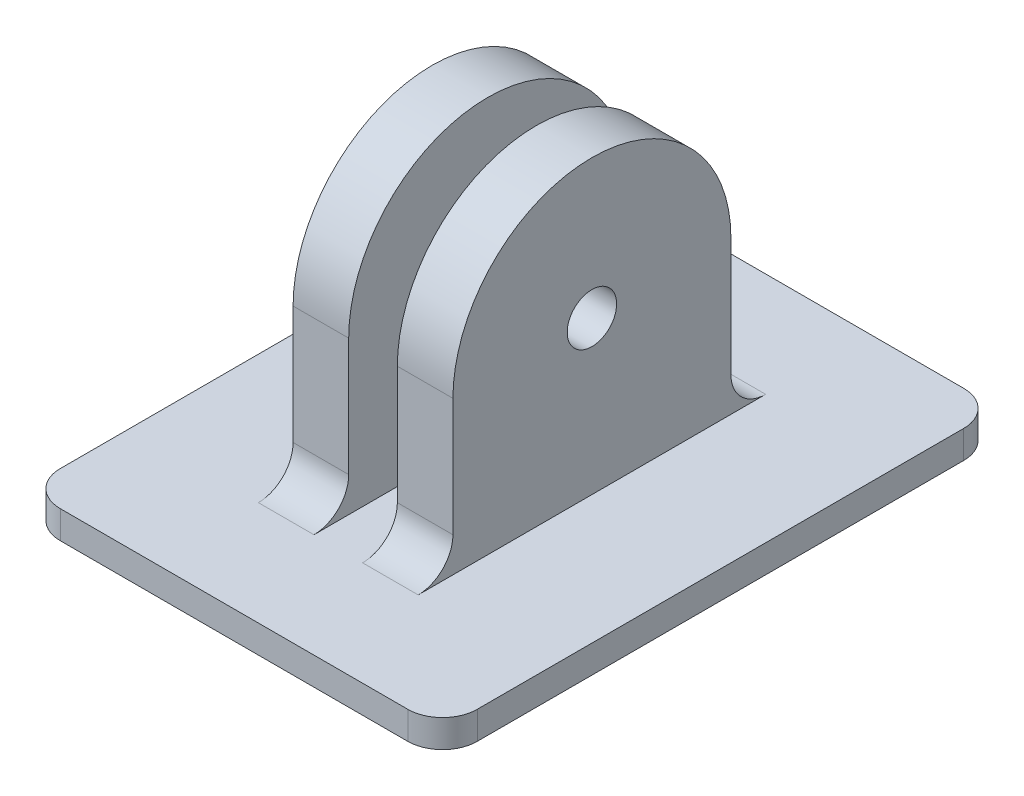
ISO-10303-21;
HEADER;
FILE_DESCRIPTION(('STEP AP214'),'2;1');
FILE_NAME('part.step','',(''),(''),'','','');
FILE_SCHEMA(('AUTOMOTIVE_DESIGN { 1 0 10303 214 1 1 1 1 }'));
ENDSEC;
DATA;
#1=APPLICATION_CONTEXT('core data for automotive mechanical design processes');
#2=APPLICATION_PROTOCOL_DEFINITION('international standard','automotive_design',2000,#1);
#3=PRODUCT_CONTEXT('',#1,'mechanical');
#4=PRODUCT('Part','Part','',(#3));
#5=PRODUCT_RELATED_PRODUCT_CATEGORY('part','',(#4));
#6=PRODUCT_DEFINITION_FORMATION('','',#4);
#7=PRODUCT_DEFINITION_CONTEXT('part definition',#1,'design');
#8=PRODUCT_DEFINITION('design','',#6,#7);
#9=PRODUCT_DEFINITION_SHAPE('','',#8);
#10=(LENGTH_UNIT() NAMED_UNIT(*) SI_UNIT(.MILLI.,.METRE.));
#11=(NAMED_UNIT(*) PLANE_ANGLE_UNIT() SI_UNIT($,.RADIAN.));
#12=(NAMED_UNIT(*) SI_UNIT($,.STERADIAN.) SOLID_ANGLE_UNIT());
#13=UNCERTAINTY_MEASURE_WITH_UNIT(LENGTH_MEASURE(1.E-05),#10,'distance_accuracy_value','');
#14=(GEOMETRIC_REPRESENTATION_CONTEXT(3) GLOBAL_UNCERTAINTY_ASSIGNED_CONTEXT((#13)) GLOBAL_UNIT_ASSIGNED_CONTEXT((#10,
#11,#12)) REPRESENTATION_CONTEXT('',''));
#15=CARTESIAN_POINT('',(0.,0.,0.));
#16=DIRECTION('',(0.,0.,1.));
#17=DIRECTION('',(1.,0.,0.));
#18=AXIS2_PLACEMENT_3D('',#15,#16,#17);
#19=CARTESIAN_POINT('',(0.,2.,0.));
#20=DIRECTION('',(0.,1.,0.));
#21=DIRECTION('',(0.,0.,1.));
#22=AXIS2_PLACEMENT_3D('',#19,#20,#21);
#23=PLANE('',#22);
#24=DIRECTION('',(0.,0.,1.));
#25=VECTOR('',#24,1.);
#26=CARTESIAN_POINT('',(1.75,2.,-10.));
#27=LINE('',#26,#25);
#28=CARTESIAN_POINT('',(1.75,2.,-12.5));
#29=VERTEX_POINT('',#28);
#30=CARTESIAN_POINT('',(1.75,2.,12.5));
#31=VERTEX_POINT('',#30);
#32=EDGE_CURVE('E233',#29,#31,#27,.T.);
#33=ORIENTED_EDGE('',*,*,#32,.F.);
#34=DIRECTION('',(-1.,0.,0.));
#35=VECTOR('',#34,1.);
#36=CARTESIAN_POINT('',(0.,2.,-12.5));
#37=LINE('',#36,#35);
#38=CARTESIAN_POINT('',(5.75,2.,-12.5));
#39=VERTEX_POINT('',#38);
#40=EDGE_CURVE('E286',#29,#39,#37,.F.);
#41=ORIENTED_EDGE('',*,*,#40,.T.);
#42=DIRECTION('',(0.,0.,-1.));
#43=VECTOR('',#42,1.);
#44=CARTESIAN_POINT('',(5.75,2.,-10.));
#45=LINE('',#44,#43);
#46=CARTESIAN_POINT('',(5.75,2.,12.5));
#47=VERTEX_POINT('',#46);
#48=EDGE_CURVE('E234',#47,#39,#45,.T.);
#49=ORIENTED_EDGE('',*,*,#48,.F.);
#50=DIRECTION('',(1.,0.,0.));
#51=VECTOR('',#50,1.);
#52=CARTESIAN_POINT('',(0.,2.,12.5));
#53=LINE('',#52,#51);
#54=EDGE_CURVE('E272',#47,#31,#53,.F.);
#55=ORIENTED_EDGE('',*,*,#54,.T.);
#56=EDGE_LOOP('',(#33,#41,#49,#55));
#57=FACE_BOUND('',#56,.T.);
#58=DIRECTION('',(0.,0.,-1.));
#59=VECTOR('',#58,1.);
#60=CARTESIAN_POINT('',(15.,2.,-20.));
#61=LINE('',#60,#59);
#62=CARTESIAN_POINT('',(15.,2.,17.5));
#63=VERTEX_POINT('',#62);
#64=CARTESIAN_POINT('',(15.,2.,-17.5));
#65=VERTEX_POINT('',#64);
#66=EDGE_CURVE('E251',#63,#65,#61,.T.);
#67=ORIENTED_EDGE('',*,*,#66,.T.);
#68=CARTESIAN_POINT('',(12.5,2.,-17.5));
#69=DIRECTION('',(0.,1.,0.));
#70=DIRECTION('',(0.,0.,1.));
#71=AXIS2_PLACEMENT_3D('',#68,#69,#70);
#72=CIRCLE('',#71,2.5);
#73=CARTESIAN_POINT('',(12.5,2.,-20.));
#74=VERTEX_POINT('',#73);
#75=EDGE_CURVE('E284',#65,#74,#72,.T.);
#76=ORIENTED_EDGE('',*,*,#75,.T.);
#77=DIRECTION('',(-1.,0.,0.));
#78=VECTOR('',#77,1.);
#79=CARTESIAN_POINT('',(-15.,2.,-20.));
#80=LINE('',#79,#78);
#81=CARTESIAN_POINT('',(-12.5,2.,-20.));
#82=VERTEX_POINT('',#81);
#83=EDGE_CURVE('E254',#74,#82,#80,.T.);
#84=ORIENTED_EDGE('',*,*,#83,.T.);
#85=CARTESIAN_POINT('',(-12.5,2.,-17.5));
#86=DIRECTION('',(0.,1.,0.));
#87=DIRECTION('',(0.,0.,1.));
#88=AXIS2_PLACEMENT_3D('',#85,#86,#87);
#89=CIRCLE('',#88,2.5);
#90=CARTESIAN_POINT('',(-15.,2.,-17.5));
#91=VERTEX_POINT('',#90);
#92=EDGE_CURVE('E282',#82,#91,#89,.T.);
#93=ORIENTED_EDGE('',*,*,#92,.T.);
#94=DIRECTION('',(0.,0.,1.));
#95=VECTOR('',#94,1.);
#96=CARTESIAN_POINT('',(-15.,2.,-20.));
#97=LINE('',#96,#95);
#98=CARTESIAN_POINT('',(-15.,2.,17.5));
#99=VERTEX_POINT('',#98);
#100=EDGE_CURVE('E244',#91,#99,#97,.T.);
#101=ORIENTED_EDGE('',*,*,#100,.T.);
#102=CARTESIAN_POINT('',(-12.5,2.,17.5));
#103=DIRECTION('',(0.,1.,0.));
#104=DIRECTION('',(0.,0.,1.));
#105=AXIS2_PLACEMENT_3D('',#102,#103,#104);
#106=CIRCLE('',#105,2.5);
#107=CARTESIAN_POINT('',(-12.5,2.,20.));
#108=VERTEX_POINT('',#107);
#109=EDGE_CURVE('E275',#99,#108,#106,.T.);
#110=ORIENTED_EDGE('',*,*,#109,.T.);
#111=DIRECTION('',(1.,0.,0.));
#112=VECTOR('',#111,1.);
#113=CARTESIAN_POINT('',(-15.,2.,20.));
#114=LINE('',#113,#112);
#115=CARTESIAN_POINT('',(12.5,2.,20.));
#116=VERTEX_POINT('',#115);
#117=EDGE_CURVE('E247',#108,#116,#114,.T.);
#118=ORIENTED_EDGE('',*,*,#117,.T.);
#119=CARTESIAN_POINT('',(12.5,2.,17.5));
#120=DIRECTION('',(0.,1.,0.));
#121=DIRECTION('',(0.,0.,1.));
#122=AXIS2_PLACEMENT_3D('',#119,#120,#121);
#123=CIRCLE('',#122,2.5);
#124=EDGE_CURVE('E277',#116,#63,#123,.T.);
#125=ORIENTED_EDGE('',*,*,#124,.T.);
#126=EDGE_LOOP('',(#67,#76,#84,#93,#101,#110,#118,#125));
#127=FACE_BOUND('',#126,.T.);
#128=DIRECTION('',(0.,0.,1.));
#129=VECTOR('',#128,1.);
#130=CARTESIAN_POINT('',(-5.75,2.,-9.99999999999999));
#131=LINE('',#130,#129);
#132=CARTESIAN_POINT('',(-5.75,2.,-12.5));
#133=VERTEX_POINT('',#132);
#134=CARTESIAN_POINT('',(-5.75,2.,12.5));
#135=VERTEX_POINT('',#134);
#136=EDGE_CURVE('E217',#133,#135,#131,.T.);
#137=ORIENTED_EDGE('',*,*,#136,.F.);
#138=DIRECTION('',(-1.,0.,0.));
#139=VECTOR('',#138,1.);
#140=CARTESIAN_POINT('',(0.,2.,-12.5));
#141=LINE('',#140,#139);
#142=CARTESIAN_POINT('',(-1.75,2.,-12.5));
#143=VERTEX_POINT('',#142);
#144=EDGE_CURVE('E279',#133,#143,#141,.F.);
#145=ORIENTED_EDGE('',*,*,#144,.T.);
#146=DIRECTION('',(0.,0.,-1.));
#147=VECTOR('',#146,1.);
#148=CARTESIAN_POINT('',(-1.75,2.,-9.99999999999999));
#149=LINE('',#148,#147);
#150=CARTESIAN_POINT('',(-1.75,2.,12.5));
#151=VERTEX_POINT('',#150);
#152=EDGE_CURVE('E210',#151,#143,#149,.T.);
#153=ORIENTED_EDGE('',*,*,#152,.F.);
#154=DIRECTION('',(1.,0.,0.));
#155=VECTOR('',#154,1.);
#156=CARTESIAN_POINT('',(0.,2.,12.5));
#157=LINE('',#156,#155);
#158=EDGE_CURVE('E269',#151,#135,#157,.F.);
#159=ORIENTED_EDGE('',*,*,#158,.T.);
#160=EDGE_LOOP('',(#137,#145,#153,#159));
#161=FACE_BOUND('',#160,.T.);
#162=ADVANCED_FACE('F36',(#57,#127,#161),#23,.T.);
#163=CARTESIAN_POINT('',(-15.,2.,-20.));
#164=DIRECTION('',(1.,0.,0.));
#165=DIRECTION('',(0.,0.,-1.));
#166=AXIS2_PLACEMENT_3D('',#163,#164,#165);
#167=PLANE('',#166);
#168=ORIENTED_EDGE('',*,*,#100,.F.);
#169=DIRECTION('',(0.,-1.,0.));
#170=VECTOR('',#169,1.);
#171=CARTESIAN_POINT('',(-15.,2.,-17.5));
#172=LINE('',#171,#170);
#173=CARTESIAN_POINT('',(-15.,0.,-17.5));
#174=VERTEX_POINT('',#173);
#175=EDGE_CURVE('E309',#91,#174,#172,.T.);
#176=ORIENTED_EDGE('',*,*,#175,.T.);
#177=DIRECTION('',(0.,0.,1.));
#178=VECTOR('',#177,1.);
#179=CARTESIAN_POINT('',(-15.,0.,-20.));
#180=LINE('',#179,#178);
#181=CARTESIAN_POINT('',(-15.,0.,17.5));
#182=VERTEX_POINT('',#181);
#183=EDGE_CURVE('E243',#174,#182,#180,.T.);
#184=ORIENTED_EDGE('',*,*,#183,.T.);
#185=DIRECTION('',(0.,-1.,0.));
#186=VECTOR('',#185,1.);
#187=CARTESIAN_POINT('',(-15.,2.,17.5));
#188=LINE('',#187,#186);
#189=EDGE_CURVE('E307',#182,#99,#188,.F.);
#190=ORIENTED_EDGE('',*,*,#189,.T.);
#191=EDGE_LOOP('',(#168,#176,#184,#190));
#192=FACE_BOUND('',#191,.T.);
#193=ADVANCED_FACE('F366',(#192),#167,.F.);
#194=CARTESIAN_POINT('',(-15.,2.,20.));
#195=DIRECTION('',(0.,0.,-1.));
#196=DIRECTION('',(-1.,0.,0.));
#197=AXIS2_PLACEMENT_3D('',#194,#195,#196);
#198=PLANE('',#197);
#199=DIRECTION('',(1.,0.,0.));
#200=VECTOR('',#199,1.);
#201=CARTESIAN_POINT('',(-15.,0.,20.));
#202=LINE('',#201,#200);
#203=CARTESIAN_POINT('',(-12.5,0.,20.));
#204=VERTEX_POINT('',#203);
#205=CARTESIAN_POINT('',(12.5,0.,20.));
#206=VERTEX_POINT('',#205);
#207=EDGE_CURVE('E260',#204,#206,#202,.T.);
#208=ORIENTED_EDGE('',*,*,#207,.T.);
#209=DIRECTION('',(0.,-1.,0.));
#210=VECTOR('',#209,1.);
#211=CARTESIAN_POINT('',(12.5,2.,20.));
#212=LINE('',#211,#210);
#213=EDGE_CURVE('E318',#206,#116,#212,.F.);
#214=ORIENTED_EDGE('',*,*,#213,.T.);
#215=ORIENTED_EDGE('',*,*,#117,.F.);
#216=DIRECTION('',(0.,-1.,0.));
#217=VECTOR('',#216,1.);
#218=CARTESIAN_POINT('',(-12.5,2.,20.));
#219=LINE('',#218,#217);
#220=EDGE_CURVE('E315',#108,#204,#219,.T.);
#221=ORIENTED_EDGE('',*,*,#220,.T.);
#222=EDGE_LOOP('',(#208,#214,#215,#221));
#223=FACE_BOUND('',#222,.T.);
#224=ADVANCED_FACE('F372',(#223),#198,.F.);
#225=CARTESIAN_POINT('',(15.,2.,-20.));
#226=DIRECTION('',(-1.,0.,0.));
#227=DIRECTION('',(0.,0.,1.));
#228=AXIS2_PLACEMENT_3D('',#225,#226,#227);
#229=PLANE('',#228);
#230=DIRECTION('',(0.,0.,-1.));
#231=VECTOR('',#230,1.);
#232=CARTESIAN_POINT('',(15.,0.,-20.));
#233=LINE('',#232,#231);
#234=CARTESIAN_POINT('',(15.,0.,17.5));
#235=VERTEX_POINT('',#234);
#236=CARTESIAN_POINT('',(15.,0.,-17.5));
#237=VERTEX_POINT('',#236);
#238=EDGE_CURVE('E263',#235,#237,#233,.T.);
#239=ORIENTED_EDGE('',*,*,#238,.T.);
#240=DIRECTION('',(0.,-1.,0.));
#241=VECTOR('',#240,1.);
#242=CARTESIAN_POINT('',(15.,2.,-17.5));
#243=LINE('',#242,#241);
#244=EDGE_CURVE('E305',#237,#65,#243,.F.);
#245=ORIENTED_EDGE('',*,*,#244,.T.);
#246=ORIENTED_EDGE('',*,*,#66,.F.);
#247=DIRECTION('',(0.,-1.,0.));
#248=VECTOR('',#247,1.);
#249=CARTESIAN_POINT('',(15.,2.,17.5));
#250=LINE('',#249,#248);
#251=EDGE_CURVE('E302',#63,#235,#250,.T.);
#252=ORIENTED_EDGE('',*,*,#251,.T.);
#253=EDGE_LOOP('',(#239,#245,#246,#252));
#254=FACE_BOUND('',#253,.T.);
#255=ADVANCED_FACE('F387',(#254),#229,.F.);
#256=CARTESIAN_POINT('',(-15.,2.,-20.));
#257=DIRECTION('',(0.,0.,1.));
#258=DIRECTION('',(1.,0.,0.));
#259=AXIS2_PLACEMENT_3D('',#256,#257,#258);
#260=PLANE('',#259);
#261=ORIENTED_EDGE('',*,*,#83,.F.);
#262=DIRECTION('',(0.,-1.,0.));
#263=VECTOR('',#262,1.);
#264=CARTESIAN_POINT('',(12.5,2.,-20.));
#265=LINE('',#264,#263);
#266=CARTESIAN_POINT('',(12.5,0.,-20.));
#267=VERTEX_POINT('',#266);
#268=EDGE_CURVE('E291',#74,#267,#265,.T.);
#269=ORIENTED_EDGE('',*,*,#268,.T.);
#270=DIRECTION('',(-1.,0.,0.));
#271=VECTOR('',#270,1.);
#272=CARTESIAN_POINT('',(-15.,0.,-20.));
#273=LINE('',#272,#271);
#274=CARTESIAN_POINT('',(-12.5,0.,-20.));
#275=VERTEX_POINT('',#274);
#276=EDGE_CURVE('E248',#267,#275,#273,.T.);
#277=ORIENTED_EDGE('',*,*,#276,.T.);
#278=DIRECTION('',(0.,-1.,0.));
#279=VECTOR('',#278,1.);
#280=CARTESIAN_POINT('',(-12.5,2.,-20.));
#281=LINE('',#280,#279);
#282=EDGE_CURVE('E289',#275,#82,#281,.F.);
#283=ORIENTED_EDGE('',*,*,#282,.T.);
#284=EDGE_LOOP('',(#261,#269,#277,#283));
#285=FACE_BOUND('',#284,.T.);
#286=ADVANCED_FACE('F383',(#285),#260,.F.);
#287=CARTESIAN_POINT('',(0.,0.,0.));
#288=DIRECTION('',(0.,1.,0.));
#289=DIRECTION('',(0.,0.,1.));
#290=AXIS2_PLACEMENT_3D('',#287,#288,#289);
#291=PLANE('',#290);
#292=ORIENTED_EDGE('',*,*,#276,.F.);
#293=CARTESIAN_POINT('',(12.5,0.,-17.5));
#294=DIRECTION('',(0.,1.,0.));
#295=DIRECTION('',(0.,0.,1.));
#296=AXIS2_PLACEMENT_3D('',#293,#294,#295);
#297=CIRCLE('',#296,2.5);
#298=EDGE_CURVE('E300',#267,#237,#297,.F.);
#299=ORIENTED_EDGE('',*,*,#298,.T.);
#300=ORIENTED_EDGE('',*,*,#238,.F.);
#301=CARTESIAN_POINT('',(12.5,0.,17.5));
#302=DIRECTION('',(0.,1.,0.));
#303=DIRECTION('',(0.,0.,1.));
#304=AXIS2_PLACEMENT_3D('',#301,#302,#303);
#305=CIRCLE('',#304,2.5);
#306=EDGE_CURVE('E296',#235,#206,#305,.F.);
#307=ORIENTED_EDGE('',*,*,#306,.T.);
#308=ORIENTED_EDGE('',*,*,#207,.F.);
#309=CARTESIAN_POINT('',(-12.5,0.,17.5));
#310=DIRECTION('',(0.,1.,0.));
#311=DIRECTION('',(0.,0.,1.));
#312=AXIS2_PLACEMENT_3D('',#309,#310,#311);
#313=CIRCLE('',#312,2.5);
#314=EDGE_CURVE('E294',#204,#182,#313,.F.);
#315=ORIENTED_EDGE('',*,*,#314,.T.);
#316=ORIENTED_EDGE('',*,*,#183,.F.);
#317=CARTESIAN_POINT('',(-12.5,0.,-17.5));
#318=DIRECTION('',(0.,1.,0.));
#319=DIRECTION('',(0.,0.,1.));
#320=AXIS2_PLACEMENT_3D('',#317,#318,#319);
#321=CIRCLE('',#320,2.5);
#322=EDGE_CURVE('E298',#174,#275,#321,.F.);
#323=ORIENTED_EDGE('',*,*,#322,.T.);
#324=EDGE_LOOP('',(#292,#299,#300,#307,#308,#315,#316,#323));
#325=FACE_BOUND('',#324,.T.);
#326=ADVANCED_FACE('F380',(#325),#291,.F.);
#327=CARTESIAN_POINT('',(1.75,13.,-10.));
#328=DIRECTION('',(1.,0.,0.));
#329=DIRECTION('',(0.,0.,-1.));
#330=AXIS2_PLACEMENT_3D('',#327,#328,#329);
#331=PLANE('',#330);
#332=CARTESIAN_POINT('',(1.75,13.,0.));
#333=DIRECTION('',(1.,0.,0.));
#334=DIRECTION('',(0.,0.,-1.));
#335=AXIS2_PLACEMENT_3D('',#332,#333,#334);
#336=CIRCLE('',#335,1.778);
#337=CARTESIAN_POINT('',(1.75,13.,-1.778));
#338=VERTEX_POINT('',#337);
#339=EDGE_CURVE('E199',#338,#338,#336,.T.);
#340=ORIENTED_EDGE('',*,*,#339,.T.);
#341=EDGE_LOOP('',(#340));
#342=FACE_BOUND('',#341,.T.);
#343=ORIENTED_EDGE('',*,*,#32,.T.);
#344=CARTESIAN_POINT('',(1.75,4.5,12.5));
#345=DIRECTION('',(1.,0.,0.));
#346=DIRECTION('',(0.,0.,-1.));
#347=AXIS2_PLACEMENT_3D('',#344,#345,#346);
#348=CIRCLE('',#347,2.5);
#349=CARTESIAN_POINT('',(1.75,4.5,10.));
#350=VERTEX_POINT('',#349);
#351=EDGE_CURVE('E337',#31,#350,#348,.T.);
#352=ORIENTED_EDGE('',*,*,#351,.T.);
#353=DIRECTION('',(0.,-1.,0.));
#354=VECTOR('',#353,1.);
#355=CARTESIAN_POINT('',(1.75,13.,10.));
#356=LINE('',#355,#354);
#357=CARTESIAN_POINT('',(1.75,13.,10.));
#358=VERTEX_POINT('',#357);
#359=EDGE_CURVE('E240',#358,#350,#356,.T.);
#360=ORIENTED_EDGE('',*,*,#359,.F.);
#361=CARTESIAN_POINT('',(1.75,13.,0.));
#362=DIRECTION('',(1.,0.,0.));
#363=DIRECTION('',(0.,0.,1.));
#364=AXIS2_PLACEMENT_3D('',#361,#362,#363);
#365=CIRCLE('',#364,10.);
#366=CARTESIAN_POINT('',(1.75,13.,-10.));
#367=VERTEX_POINT('',#366);
#368=EDGE_CURVE('E198',#367,#358,#365,.T.);
#369=ORIENTED_EDGE('',*,*,#368,.F.);
#370=DIRECTION('',(0.,-1.,0.));
#371=VECTOR('',#370,1.);
#372=CARTESIAN_POINT('',(1.75,13.,-10.));
#373=LINE('',#372,#371);
#374=CARTESIAN_POINT('',(1.75,4.5,-10.));
#375=VERTEX_POINT('',#374);
#376=EDGE_CURVE('E180',#367,#375,#373,.T.);
#377=ORIENTED_EDGE('',*,*,#376,.T.);
#378=CARTESIAN_POINT('',(1.75,4.5,-12.5));
#379=DIRECTION('',(1.,0.,0.));
#380=DIRECTION('',(0.,0.,-1.));
#381=AXIS2_PLACEMENT_3D('',#378,#379,#380);
#382=CIRCLE('',#381,2.5);
#383=EDGE_CURVE('E325',#375,#29,#382,.T.);
#384=ORIENTED_EDGE('',*,*,#383,.T.);
#385=EDGE_LOOP('',(#343,#352,#360,#369,#377,#384));
#386=FACE_BOUND('',#385,.T.);
#387=ADVANCED_FACE('F378',(#342,#386),#331,.F.);
#388=CARTESIAN_POINT('',(1.75,13.,10.));
#389=DIRECTION('',(0.,0.,-1.));
#390=DIRECTION('',(-1.,0.,0.));
#391=AXIS2_PLACEMENT_3D('',#388,#389,#390);
#392=PLANE('',#391);
#393=ORIENTED_EDGE('',*,*,#359,.T.);
#394=DIRECTION('',(1.,0.,0.));
#395=VECTOR('',#394,1.);
#396=CARTESIAN_POINT('',(1.75,4.5,10.));
#397=LINE('',#396,#395);
#398=CARTESIAN_POINT('',(5.75,4.5,10.));
#399=VERTEX_POINT('',#398);
#400=EDGE_CURVE('E320',#350,#399,#397,.T.);
#401=ORIENTED_EDGE('',*,*,#400,.T.);
#402=DIRECTION('',(0.,-1.,0.));
#403=VECTOR('',#402,1.);
#404=CARTESIAN_POINT('',(5.75,13.,10.));
#405=LINE('',#404,#403);
#406=CARTESIAN_POINT('',(5.75,13.,10.));
#407=VERTEX_POINT('',#406);
#408=EDGE_CURVE('E194',#407,#399,#405,.T.);
#409=ORIENTED_EDGE('',*,*,#408,.F.);
#410=DIRECTION('',(1.,0.,0.));
#411=VECTOR('',#410,1.);
#412=CARTESIAN_POINT('',(1.75,13.,10.));
#413=LINE('',#412,#411);
#414=EDGE_CURVE('E185',#358,#407,#413,.T.);
#415=ORIENTED_EDGE('',*,*,#414,.F.);
#416=EDGE_LOOP('',(#393,#401,#409,#415));
#417=FACE_BOUND('',#416,.T.);
#418=ADVANCED_FACE('F429',(#417),#392,.F.);
#419=CARTESIAN_POINT('',(5.75,13.,-10.));
#420=DIRECTION('',(-1.,0.,0.));
#421=DIRECTION('',(0.,0.,1.));
#422=AXIS2_PLACEMENT_3D('',#419,#420,#421);
#423=PLANE('',#422);
#424=CARTESIAN_POINT('',(5.75,13.,0.));
#425=DIRECTION('',(1.,0.,0.));
#426=DIRECTION('',(0.,0.,-1.));
#427=AXIS2_PLACEMENT_3D('',#424,#425,#426);
#428=CIRCLE('',#427,1.778);
#429=CARTESIAN_POINT('',(5.75,13.,-1.778));
#430=VERTEX_POINT('',#429);
#431=EDGE_CURVE('E621',#430,#430,#428,.T.);
#432=ORIENTED_EDGE('',*,*,#431,.F.);
#433=EDGE_LOOP('',(#432));
#434=FACE_BOUND('',#433,.T.);
#435=ORIENTED_EDGE('',*,*,#48,.T.);
#436=CARTESIAN_POINT('',(5.75,4.5,-12.5));
#437=DIRECTION('',(-1.,0.,0.));
#438=DIRECTION('',(0.,0.,1.));
#439=AXIS2_PLACEMENT_3D('',#436,#437,#438);
#440=CIRCLE('',#439,2.5);
#441=CARTESIAN_POINT('',(5.75,4.5,-10.));
#442=VERTEX_POINT('',#441);
#443=EDGE_CURVE('E193',#39,#442,#440,.T.);
#444=ORIENTED_EDGE('',*,*,#443,.T.);
#445=DIRECTION('',(0.,-1.,0.));
#446=VECTOR('',#445,1.);
#447=CARTESIAN_POINT('',(5.75,13.,-10.));
#448=LINE('',#447,#446);
#449=CARTESIAN_POINT('',(5.75,13.,-9.99999999999999));
#450=VERTEX_POINT('',#449);
#451=EDGE_CURVE('E177',#450,#442,#448,.T.);
#452=ORIENTED_EDGE('',*,*,#451,.F.);
#453=CARTESIAN_POINT('',(5.75,13.,0.));
#454=DIRECTION('',(1.,0.,0.));
#455=DIRECTION('',(0.,0.,1.));
#456=AXIS2_PLACEMENT_3D('',#453,#454,#455);
#457=CIRCLE('',#456,10.);
#458=EDGE_CURVE('E191',#450,#407,#457,.T.);
#459=ORIENTED_EDGE('',*,*,#458,.T.);
#460=ORIENTED_EDGE('',*,*,#408,.T.);
#461=CARTESIAN_POINT('',(5.75,4.5,12.5));
#462=DIRECTION('',(-1.,0.,0.));
#463=DIRECTION('',(0.,0.,1.));
#464=AXIS2_PLACEMENT_3D('',#461,#462,#463);
#465=CIRCLE('',#464,2.5);
#466=EDGE_CURVE('E334',#399,#47,#465,.T.);
#467=ORIENTED_EDGE('',*,*,#466,.T.);
#468=EDGE_LOOP('',(#435,#444,#452,#459,#460,#467));
#469=FACE_BOUND('',#468,.T.);
#470=ADVANCED_FACE('F189',(#434,#469),#423,.F.);
#471=CARTESIAN_POINT('',(1.75,13.,-10.));
#472=DIRECTION('',(0.,0.,1.));
#473=DIRECTION('',(1.,0.,0.));
#474=AXIS2_PLACEMENT_3D('',#471,#472,#473);
#475=PLANE('',#474);
#476=ORIENTED_EDGE('',*,*,#451,.T.);
#477=DIRECTION('',(-1.,0.,0.));
#478=VECTOR('',#477,1.);
#479=CARTESIAN_POINT('',(1.75,4.5,-10.));
#480=LINE('',#479,#478);
#481=EDGE_CURVE('E257',#442,#375,#480,.T.);
#482=ORIENTED_EDGE('',*,*,#481,.T.);
#483=ORIENTED_EDGE('',*,*,#376,.F.);
#484=DIRECTION('',(-1.,0.,0.));
#485=VECTOR('',#484,1.);
#486=CARTESIAN_POINT('',(1.75,13.,-10.));
#487=LINE('',#486,#485);
#488=EDGE_CURVE('E173',#450,#367,#487,.T.);
#489=ORIENTED_EDGE('',*,*,#488,.F.);
#490=EDGE_LOOP('',(#476,#482,#483,#489));
#491=FACE_BOUND('',#490,.T.);
#492=ADVANCED_FACE('F175',(#491),#475,.F.);
#493=CARTESIAN_POINT('',(-1.75,13.,-9.99999999999999));
#494=DIRECTION('',(-1.,0.,0.));
#495=DIRECTION('',(0.,0.,1.));
#496=AXIS2_PLACEMENT_3D('',#493,#494,#495);
#497=PLANE('',#496);
#498=CARTESIAN_POINT('',(-1.75,13.,0.));
#499=DIRECTION('',(-1.,0.,0.));
#500=DIRECTION('',(0.,0.,1.));
#501=AXIS2_PLACEMENT_3D('',#498,#499,#500);
#502=CIRCLE('',#501,1.778);
#503=CARTESIAN_POINT('',(-1.75,13.,1.778));
#504=VERTEX_POINT('',#503);
#505=EDGE_CURVE('E204',#504,#504,#502,.T.);
#506=ORIENTED_EDGE('',*,*,#505,.T.);
#507=EDGE_LOOP('',(#506));
#508=FACE_BOUND('',#507,.T.);
#509=ORIENTED_EDGE('',*,*,#152,.T.);
#510=CARTESIAN_POINT('',(-1.75,4.5,-12.5));
#511=DIRECTION('',(-1.,0.,0.));
#512=DIRECTION('',(0.,0.,1.));
#513=AXIS2_PLACEMENT_3D('',#510,#511,#512);
#514=CIRCLE('',#513,2.5);
#515=CARTESIAN_POINT('',(-1.75,4.5,-9.99999999999999));
#516=VERTEX_POINT('',#515);
#517=EDGE_CURVE('E332',#143,#516,#514,.T.);
#518=ORIENTED_EDGE('',*,*,#517,.T.);
#519=DIRECTION('',(0.,-1.,0.));
#520=VECTOR('',#519,1.);
#521=CARTESIAN_POINT('',(-1.75,13.,-9.99999999999999));
#522=LINE('',#521,#520);
#523=CARTESIAN_POINT('',(-1.75,13.,-9.99999999999999));
#524=VERTEX_POINT('',#523);
#525=EDGE_CURVE('E230',#524,#516,#522,.T.);
#526=ORIENTED_EDGE('',*,*,#525,.F.);
#527=CARTESIAN_POINT('',(-1.75,13.,0.));
#528=DIRECTION('',(-1.,0.,0.));
#529=DIRECTION('',(0.,0.,-1.));
#530=AXIS2_PLACEMENT_3D('',#527,#528,#529);
#531=CIRCLE('',#530,9.99999999999999);
#532=CARTESIAN_POINT('',(-1.75,13.,9.99999999999999));
#533=VERTEX_POINT('',#532);
#534=EDGE_CURVE('E207',#533,#524,#531,.T.);
#535=ORIENTED_EDGE('',*,*,#534,.F.);
#536=DIRECTION('',(0.,-1.,0.));
#537=VECTOR('',#536,1.);
#538=CARTESIAN_POINT('',(-1.75,13.,9.99999999999999));
#539=LINE('',#538,#537);
#540=CARTESIAN_POINT('',(-1.75,4.5,9.99999999999999));
#541=VERTEX_POINT('',#540);
#542=EDGE_CURVE('E220',#533,#541,#539,.T.);
#543=ORIENTED_EDGE('',*,*,#542,.T.);
#544=CARTESIAN_POINT('',(-1.75,4.5,12.5));
#545=DIRECTION('',(-1.,0.,0.));
#546=DIRECTION('',(0.,0.,1.));
#547=AXIS2_PLACEMENT_3D('',#544,#545,#546);
#548=CIRCLE('',#547,2.5);
#549=EDGE_CURVE('E44',#541,#151,#548,.T.);
#550=ORIENTED_EDGE('',*,*,#549,.T.);
#551=EDGE_LOOP('',(#509,#518,#526,#535,#543,#550));
#552=FACE_BOUND('',#551,.T.);
#553=ADVANCED_FACE('F339',(#508,#552),#497,.F.);
#554=CARTESIAN_POINT('',(-1.75,13.,-9.99999999999999));
#555=DIRECTION('',(0.,0.,1.));
#556=DIRECTION('',(1.,0.,0.));
#557=AXIS2_PLACEMENT_3D('',#554,#555,#556);
#558=PLANE('',#557);
#559=ORIENTED_EDGE('',*,*,#525,.T.);
#560=DIRECTION('',(-1.,0.,0.));
#561=VECTOR('',#560,1.);
#562=CARTESIAN_POINT('',(-1.75,4.5,-9.99999999999999));
#563=LINE('',#562,#561);
#564=CARTESIAN_POINT('',(-5.75,4.5,-9.99999999999999));
#565=VERTEX_POINT('',#564);
#566=EDGE_CURVE('E312',#516,#565,#563,.T.);
#567=ORIENTED_EDGE('',*,*,#566,.T.);
#568=DIRECTION('',(0.,-1.,0.));
#569=VECTOR('',#568,1.);
#570=CARTESIAN_POINT('',(-5.75,13.,-9.99999999999999));
#571=LINE('',#570,#569);
#572=CARTESIAN_POINT('',(-5.75,13.,-9.99999999999999));
#573=VERTEX_POINT('',#572);
#574=EDGE_CURVE('E227',#573,#565,#571,.T.);
#575=ORIENTED_EDGE('',*,*,#574,.F.);
#576=DIRECTION('',(-1.,0.,0.));
#577=VECTOR('',#576,1.);
#578=CARTESIAN_POINT('',(-1.75,13.,-9.99999999999999));
#579=LINE('',#578,#577);
#580=EDGE_CURVE('E213',#524,#573,#579,.T.);
#581=ORIENTED_EDGE('',*,*,#580,.F.);
#582=EDGE_LOOP('',(#559,#567,#575,#581));
#583=FACE_BOUND('',#582,.T.);
#584=ADVANCED_FACE('F349',(#583),#558,.F.);
#585=CARTESIAN_POINT('',(-5.75,13.,-9.99999999999999));
#586=DIRECTION('',(1.,0.,0.));
#587=DIRECTION('',(0.,0.,-1.));
#588=AXIS2_PLACEMENT_3D('',#585,#586,#587);
#589=PLANE('',#588);
#590=CARTESIAN_POINT('',(-5.75,13.,0.));
#591=DIRECTION('',(1.,0.,0.));
#592=DIRECTION('',(0.,0.,-1.));
#593=AXIS2_PLACEMENT_3D('',#590,#591,#592);
#594=CIRCLE('',#593,1.778);
#595=CARTESIAN_POINT('',(-5.75,13.,-1.778));
#596=VERTEX_POINT('',#595);
#597=EDGE_CURVE('E617',#596,#596,#594,.F.);
#598=ORIENTED_EDGE('',*,*,#597,.F.);
#599=EDGE_LOOP('',(#598));
#600=FACE_BOUND('',#599,.T.);
#601=ORIENTED_EDGE('',*,*,#136,.T.);
#602=CARTESIAN_POINT('',(-5.75,4.5,12.5));
#603=DIRECTION('',(1.,0.,0.));
#604=DIRECTION('',(0.,0.,-1.));
#605=AXIS2_PLACEMENT_3D('',#602,#603,#604);
#606=CIRCLE('',#605,2.5);
#607=CARTESIAN_POINT('',(-5.75,4.5,9.99999999999999));
#608=VERTEX_POINT('',#607);
#609=EDGE_CURVE('E11',#135,#608,#606,.T.);
#610=ORIENTED_EDGE('',*,*,#609,.T.);
#611=DIRECTION('',(0.,-1.,0.));
#612=VECTOR('',#611,1.);
#613=CARTESIAN_POINT('',(-5.75,13.,9.99999999999999));
#614=LINE('',#613,#612);
#615=CARTESIAN_POINT('',(-5.75,13.,9.99999999999999));
#616=VERTEX_POINT('',#615);
#617=EDGE_CURVE('E225',#616,#608,#614,.T.);
#618=ORIENTED_EDGE('',*,*,#617,.F.);
#619=CARTESIAN_POINT('',(-5.75,13.,0.));
#620=DIRECTION('',(-1.,0.,0.));
#621=DIRECTION('',(0.,0.,-1.));
#622=AXIS2_PLACEMENT_3D('',#619,#620,#621);
#623=CIRCLE('',#622,9.99999999999999);
#624=EDGE_CURVE('E201',#616,#573,#623,.T.);
#625=ORIENTED_EDGE('',*,*,#624,.T.);
#626=ORIENTED_EDGE('',*,*,#574,.T.);
#627=CARTESIAN_POINT('',(-5.75,4.5,-12.5));
#628=DIRECTION('',(1.,0.,0.));
#629=DIRECTION('',(0.,0.,-1.));
#630=AXIS2_PLACEMENT_3D('',#627,#628,#629);
#631=CIRCLE('',#630,2.5);
#632=EDGE_CURVE('E329',#565,#133,#631,.T.);
#633=ORIENTED_EDGE('',*,*,#632,.T.);
#634=EDGE_LOOP('',(#601,#610,#618,#625,#626,#633));
#635=FACE_BOUND('',#634,.T.);
#636=ADVANCED_FACE('F353',(#600,#635),#589,.F.);
#637=CARTESIAN_POINT('',(-1.75,13.,9.99999999999999));
#638=DIRECTION('',(0.,0.,-1.));
#639=DIRECTION('',(-1.,0.,0.));
#640=AXIS2_PLACEMENT_3D('',#637,#638,#639);
#641=PLANE('',#640);
#642=ORIENTED_EDGE('',*,*,#617,.T.);
#643=DIRECTION('',(1.,0.,0.));
#644=VECTOR('',#643,1.);
#645=CARTESIAN_POINT('',(-1.75,4.5,9.99999999999999));
#646=LINE('',#645,#644);
#647=EDGE_CURVE('E323',#608,#541,#646,.T.);
#648=ORIENTED_EDGE('',*,*,#647,.T.);
#649=ORIENTED_EDGE('',*,*,#542,.F.);
#650=DIRECTION('',(1.,0.,0.));
#651=VECTOR('',#650,1.);
#652=CARTESIAN_POINT('',(-1.75,13.,9.99999999999999));
#653=LINE('',#652,#651);
#654=EDGE_CURVE('E216',#616,#533,#653,.T.);
#655=ORIENTED_EDGE('',*,*,#654,.F.);
#656=EDGE_LOOP('',(#642,#648,#649,#655));
#657=FACE_BOUND('',#656,.T.);
#658=ADVANCED_FACE('F355',(#657),#641,.F.);
#659=CARTESIAN_POINT('',(-1.75,13.,0.));
#660=DIRECTION('',(-1.,0.,0.));
#661=DIRECTION('',(0.,0.,1.));
#662=AXIS2_PLACEMENT_3D('',#659,#660,#661);
#663=CYLINDRICAL_SURFACE('',#662,9.99999999999999);
#664=ORIENTED_EDGE('',*,*,#624,.F.);
#665=ORIENTED_EDGE('',*,*,#654,.T.);
#666=ORIENTED_EDGE('',*,*,#534,.T.);
#667=ORIENTED_EDGE('',*,*,#580,.T.);
#668=EDGE_LOOP('',(#664,#665,#666,#667));
#669=FACE_BOUND('',#668,.T.);
#670=ADVANCED_FACE('F352',(#669),#663,.T.);
#671=CARTESIAN_POINT('',(1.75,13.,0.));
#672=DIRECTION('',(1.,0.,0.));
#673=DIRECTION('',(0.,0.,-1.));
#674=AXIS2_PLACEMENT_3D('',#671,#672,#673);
#675=CYLINDRICAL_SURFACE('',#674,10.);
#676=ORIENTED_EDGE('',*,*,#458,.F.);
#677=ORIENTED_EDGE('',*,*,#488,.T.);
#678=ORIENTED_EDGE('',*,*,#368,.T.);
#679=ORIENTED_EDGE('',*,*,#414,.T.);
#680=EDGE_LOOP('',(#676,#677,#678,#679));
#681=FACE_BOUND('',#680,.T.);
#682=ADVANCED_FACE('F197',(#681),#675,.T.);
#683=CARTESIAN_POINT('',(-10.7789434277987,13.,0.));
#684=DIRECTION('',(1.,0.,0.));
#685=DIRECTION('',(0.,0.,-1.));
#686=AXIS2_PLACEMENT_3D('',#683,#684,#685);
#687=CYLINDRICAL_SURFACE('',#686,1.778);
#688=ORIENTED_EDGE('',*,*,#597,.T.);
#689=EDGE_LOOP('',(#688));
#690=FACE_BOUND('',#689,.T.);
#691=ORIENTED_EDGE('',*,*,#505,.F.);
#692=EDGE_LOOP('',(#691));
#693=FACE_BOUND('',#692,.T.);
#694=ADVANCED_FACE('F516',(#690,#693),#687,.F.);
#695=ORIENTED_EDGE('',*,*,#431,.T.);
#696=EDGE_LOOP('',(#695));
#697=FACE_BOUND('',#696,.T.);
#698=ORIENTED_EDGE('',*,*,#339,.F.);
#699=EDGE_LOOP('',(#698));
#700=FACE_BOUND('',#699,.T.);
#701=ADVANCED_FACE('F399',(#697,#700),#687,.F.);
#702=CARTESIAN_POINT('',(1.75,4.5,-12.5));
#703=DIRECTION('',(-1.,0.,0.));
#704=DIRECTION('',(0.,0.,1.));
#705=AXIS2_PLACEMENT_3D('',#702,#703,#704);
#706=CYLINDRICAL_SURFACE('',#705,2.5);
#707=ORIENTED_EDGE('',*,*,#443,.F.);
#708=ORIENTED_EDGE('',*,*,#40,.F.);
#709=ORIENTED_EDGE('',*,*,#383,.F.);
#710=ORIENTED_EDGE('',*,*,#481,.F.);
#711=EDGE_LOOP('',(#707,#708,#709,#710));
#712=FACE_BOUND('',#711,.T.);
#713=ADVANCED_FACE('F395',(#712),#706,.F.);
#714=CARTESIAN_POINT('',(12.5,2.,-17.5));
#715=DIRECTION('',(0.,-1.,0.));
#716=DIRECTION('',(0.,0.,-1.));
#717=AXIS2_PLACEMENT_3D('',#714,#715,#716);
#718=CYLINDRICAL_SURFACE('',#717,2.5);
#719=ORIENTED_EDGE('',*,*,#75,.F.);
#720=ORIENTED_EDGE('',*,*,#244,.F.);
#721=ORIENTED_EDGE('',*,*,#298,.F.);
#722=ORIENTED_EDGE('',*,*,#268,.F.);
#723=EDGE_LOOP('',(#719,#720,#721,#722));
#724=FACE_BOUND('',#723,.T.);
#725=ADVANCED_FACE('F398',(#724),#718,.T.);
#726=CARTESIAN_POINT('',(-12.5,2.,-17.5));
#727=DIRECTION('',(0.,-1.,0.));
#728=DIRECTION('',(0.,0.,-1.));
#729=AXIS2_PLACEMENT_3D('',#726,#727,#728);
#730=CYLINDRICAL_SURFACE('',#729,2.5);
#731=ORIENTED_EDGE('',*,*,#92,.F.);
#732=ORIENTED_EDGE('',*,*,#282,.F.);
#733=ORIENTED_EDGE('',*,*,#322,.F.);
#734=ORIENTED_EDGE('',*,*,#175,.F.);
#735=EDGE_LOOP('',(#731,#732,#733,#734));
#736=FACE_BOUND('',#735,.T.);
#737=ADVANCED_FACE('F403',(#736),#730,.T.);
#738=CARTESIAN_POINT('',(-1.75,4.5,-12.5));
#739=DIRECTION('',(-1.,0.,0.));
#740=DIRECTION('',(0.,0.,1.));
#741=AXIS2_PLACEMENT_3D('',#738,#739,#740);
#742=CYLINDRICAL_SURFACE('',#741,2.5);
#743=ORIENTED_EDGE('',*,*,#517,.F.);
#744=ORIENTED_EDGE('',*,*,#144,.F.);
#745=ORIENTED_EDGE('',*,*,#632,.F.);
#746=ORIENTED_EDGE('',*,*,#566,.F.);
#747=EDGE_LOOP('',(#743,#744,#745,#746));
#748=FACE_BOUND('',#747,.T.);
#749=ADVANCED_FACE('F346',(#748),#742,.F.);
#750=CARTESIAN_POINT('',(12.5,2.,17.5));
#751=DIRECTION('',(0.,-1.,0.));
#752=DIRECTION('',(0.,0.,-1.));
#753=AXIS2_PLACEMENT_3D('',#750,#751,#752);
#754=CYLINDRICAL_SURFACE('',#753,2.5);
#755=ORIENTED_EDGE('',*,*,#124,.F.);
#756=ORIENTED_EDGE('',*,*,#213,.F.);
#757=ORIENTED_EDGE('',*,*,#306,.F.);
#758=ORIENTED_EDGE('',*,*,#251,.F.);
#759=EDGE_LOOP('',(#755,#756,#757,#758));
#760=FACE_BOUND('',#759,.T.);
#761=ADVANCED_FACE('F410',(#760),#754,.T.);
#762=CARTESIAN_POINT('',(-12.5,2.,17.5));
#763=DIRECTION('',(0.,-1.,0.));
#764=DIRECTION('',(0.,0.,-1.));
#765=AXIS2_PLACEMENT_3D('',#762,#763,#764);
#766=CYLINDRICAL_SURFACE('',#765,2.5);
#767=ORIENTED_EDGE('',*,*,#109,.F.);
#768=ORIENTED_EDGE('',*,*,#189,.F.);
#769=ORIENTED_EDGE('',*,*,#314,.F.);
#770=ORIENTED_EDGE('',*,*,#220,.F.);
#771=EDGE_LOOP('',(#767,#768,#769,#770));
#772=FACE_BOUND('',#771,.T.);
#773=ADVANCED_FACE('F413',(#772),#766,.T.);
#774=CARTESIAN_POINT('',(1.75,4.5,12.5));
#775=DIRECTION('',(1.,0.,0.));
#776=DIRECTION('',(0.,0.,-1.));
#777=AXIS2_PLACEMENT_3D('',#774,#775,#776);
#778=CYLINDRICAL_SURFACE('',#777,2.5);
#779=ORIENTED_EDGE('',*,*,#351,.F.);
#780=ORIENTED_EDGE('',*,*,#54,.F.);
#781=ORIENTED_EDGE('',*,*,#466,.F.);
#782=ORIENTED_EDGE('',*,*,#400,.F.);
#783=EDGE_LOOP('',(#779,#780,#781,#782));
#784=FACE_BOUND('',#783,.T.);
#785=ADVANCED_FACE('F416',(#784),#778,.F.);
#786=CARTESIAN_POINT('',(-1.75,4.5,12.5));
#787=DIRECTION('',(1.,0.,0.));
#788=DIRECTION('',(0.,0.,-1.));
#789=AXIS2_PLACEMENT_3D('',#786,#787,#788);
#790=CYLINDRICAL_SURFACE('',#789,2.5);
#791=ORIENTED_EDGE('',*,*,#609,.F.);
#792=ORIENTED_EDGE('',*,*,#158,.F.);
#793=ORIENTED_EDGE('',*,*,#549,.F.);
#794=ORIENTED_EDGE('',*,*,#647,.F.);
#795=EDGE_LOOP('',(#791,#792,#793,#794));
#796=FACE_BOUND('',#795,.T.);
#797=ADVANCED_FACE('F38',(#796),#790,.F.);
#798=CLOSED_SHELL('',(#162,#193,#224,#255,#286,#326,#387,#418,#470,#492,#553,#584,#636,#658,
#670,#682,#694,#701,#713,#725,#737,#749,#761,#773,#785,#797));
#799=MANIFOLD_SOLID_BREP('B2',#798);
#800=ADVANCED_BREP_SHAPE_REPRESENTATION('',(#18,#799),#14);
#801=SHAPE_DEFINITION_REPRESENTATION(#9,#800);
ENDSEC;
END-ISO-10303-21;
